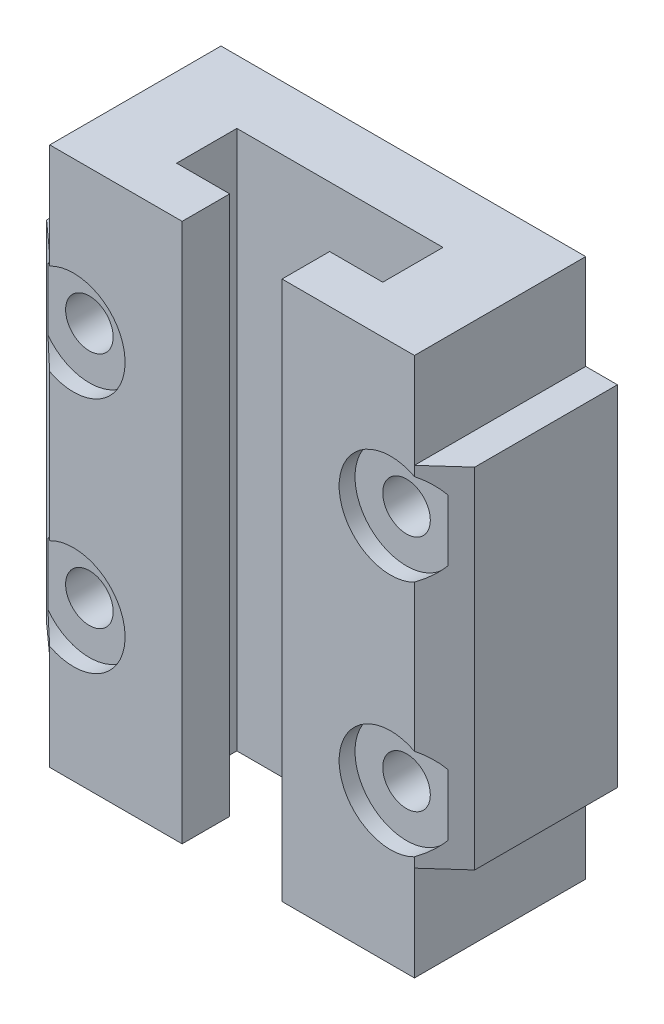
ISO-10303-21;
HEADER;
FILE_DESCRIPTION(('STEP AP214'),'2;1');
FILE_NAME('part.step','',(''),(''),'','','');
FILE_SCHEMA(('AUTOMOTIVE_DESIGN { 1 0 10303 214 1 1 1 1 }'));
ENDSEC;
DATA;
#1=APPLICATION_CONTEXT('core data for automotive mechanical design processes');
#2=APPLICATION_PROTOCOL_DEFINITION('international standard','automotive_design',2000,#1);
#3=PRODUCT_CONTEXT('',#1,'mechanical');
#4=PRODUCT('Part','Part','',(#3));
#5=PRODUCT_RELATED_PRODUCT_CATEGORY('part','',(#4));
#6=PRODUCT_DEFINITION_FORMATION('','',#4);
#7=PRODUCT_DEFINITION_CONTEXT('part definition',#1,'design');
#8=PRODUCT_DEFINITION('design','',#6,#7);
#9=PRODUCT_DEFINITION_SHAPE('','',#8);
#10=(LENGTH_UNIT() NAMED_UNIT(*) SI_UNIT(.MILLI.,.METRE.));
#11=(NAMED_UNIT(*) PLANE_ANGLE_UNIT() SI_UNIT($,.RADIAN.));
#12=(NAMED_UNIT(*) SI_UNIT($,.STERADIAN.) SOLID_ANGLE_UNIT());
#13=UNCERTAINTY_MEASURE_WITH_UNIT(LENGTH_MEASURE(1.E-05),#10,'distance_accuracy_value','');
#14=(GEOMETRIC_REPRESENTATION_CONTEXT(3) GLOBAL_UNCERTAINTY_ASSIGNED_CONTEXT((#13)) GLOBAL_UNIT_ASSIGNED_CONTEXT((#10,
#11,#12)) REPRESENTATION_CONTEXT('',''));
#15=CARTESIAN_POINT('',(0.,0.,0.));
#16=DIRECTION('',(0.,0.,1.));
#17=DIRECTION('',(1.,0.,0.));
#18=AXIS2_PLACEMENT_3D('',#15,#16,#17);
#19=CARTESIAN_POINT('',(-11.5,34.,5.4));
#20=DIRECTION('',(1.,0.,0.));
#21=DIRECTION('',(0.,0.,-1.));
#22=AXIS2_PLACEMENT_3D('',#19,#20,#21);
#23=PLANE('',#22);
#24=DIRECTION('',(0.,0.,1.));
#25=VECTOR('',#24,1.);
#26=CARTESIAN_POINT('',(-11.5,28.,5.4));
#27=LINE('',#26,#25);
#28=CARTESIAN_POINT('',(-11.5,28.,-5.4));
#29=VERTEX_POINT('',#28);
#30=CARTESIAN_POINT('',(-11.5,28.,5.4));
#31=VERTEX_POINT('',#30);
#32=EDGE_CURVE('E420',#29,#31,#27,.T.);
#33=ORIENTED_EDGE('',*,*,#32,.T.);
#34=DIRECTION('',(0.,-1.,0.));
#35=VECTOR('',#34,1.);
#36=CARTESIAN_POINT('',(-11.5,34.,5.4));
#37=LINE('',#36,#35);
#38=CARTESIAN_POINT('',(-11.5,34.,5.4));
#39=VERTEX_POINT('',#38);
#40=EDGE_CURVE('E252',#39,#31,#37,.T.);
#41=ORIENTED_EDGE('',*,*,#40,.F.);
#42=DIRECTION('',(0.,0.,1.));
#43=VECTOR('',#42,1.);
#44=CARTESIAN_POINT('',(-11.5,34.,5.4));
#45=LINE('',#44,#43);
#46=CARTESIAN_POINT('',(-11.5,34.,-5.4));
#47=VERTEX_POINT('',#46);
#48=EDGE_CURVE('E510',#47,#39,#45,.T.);
#49=ORIENTED_EDGE('',*,*,#48,.F.);
#50=DIRECTION('',(0.,-1.,0.));
#51=VECTOR('',#50,1.);
#52=CARTESIAN_POINT('',(-11.5,34.,-5.4));
#53=LINE('',#52,#51);
#54=EDGE_CURVE('E363',#47,#29,#53,.T.);
#55=ORIENTED_EDGE('',*,*,#54,.T.);
#56=EDGE_LOOP('',(#33,#41,#49,#55));
#57=FACE_BOUND('',#56,.T.);
#58=ADVANCED_FACE('F41',(#57),#23,.F.);
#59=CARTESIAN_POINT('',(11.5,34.,5.4));
#60=DIRECTION('',(-1.,0.,0.));
#61=DIRECTION('',(0.,0.,1.));
#62=AXIS2_PLACEMENT_3D('',#59,#60,#61);
#63=PLANE('',#62);
#64=DIRECTION('',(0.,-1.,0.));
#65=VECTOR('',#64,1.);
#66=CARTESIAN_POINT('',(11.5,34.,5.4));
#67=LINE('',#66,#65);
#68=CARTESIAN_POINT('',(11.5,34.,5.4));
#69=VERTEX_POINT('',#68);
#70=CARTESIAN_POINT('',(11.5,28.,5.4));
#71=VERTEX_POINT('',#70);
#72=EDGE_CURVE('E355',#69,#71,#67,.T.);
#73=ORIENTED_EDGE('',*,*,#72,.T.);
#74=DIRECTION('',(0.,0.,-1.));
#75=VECTOR('',#74,1.);
#76=CARTESIAN_POINT('',(11.5,28.,5.4));
#77=LINE('',#76,#75);
#78=CARTESIAN_POINT('',(11.5,28.,-5.4));
#79=VERTEX_POINT('',#78);
#80=EDGE_CURVE('E438',#71,#79,#77,.T.);
#81=ORIENTED_EDGE('',*,*,#80,.T.);
#82=DIRECTION('',(0.,-1.,0.));
#83=VECTOR('',#82,1.);
#84=CARTESIAN_POINT('',(11.5,34.,-5.4));
#85=LINE('',#84,#83);
#86=CARTESIAN_POINT('',(11.5,34.,-5.4));
#87=VERTEX_POINT('',#86);
#88=EDGE_CURVE('E366',#87,#79,#85,.T.);
#89=ORIENTED_EDGE('',*,*,#88,.F.);
#90=DIRECTION('',(0.,0.,-1.));
#91=VECTOR('',#90,1.);
#92=CARTESIAN_POINT('',(11.5,34.,5.4));
#93=LINE('',#92,#91);
#94=EDGE_CURVE('E504',#69,#87,#93,.T.);
#95=ORIENTED_EDGE('',*,*,#94,.F.);
#96=EDGE_LOOP('',(#73,#81,#89,#95));
#97=FACE_BOUND('',#96,.T.);
#98=ADVANCED_FACE('F326',(#97),#63,.F.);
#99=CARTESIAN_POINT('',(-11.5,34.,5.4));
#100=DIRECTION('',(0.,0.,-1.));
#101=DIRECTION('',(-1.,0.,0.));
#102=AXIS2_PLACEMENT_3D('',#99,#100,#101);
#103=PLANE('',#102);
#104=DIRECTION('',(0.,-1.,0.));
#105=VECTOR('',#104,1.);
#106=CARTESIAN_POINT('',(11.5,30.6907248094147,5.4));
#107=LINE('',#106,#105);
#108=CARTESIAN_POINT('',(11.5,21.6168593513323,5.4));
#109=VERTEX_POINT('',#108);
#110=CARTESIAN_POINT('',(11.5,12.3831406486677,5.4));
#111=VERTEX_POINT('',#110);
#112=EDGE_CURVE('E390',#109,#111,#107,.T.);
#113=ORIENTED_EDGE('',*,*,#112,.F.);
#114=CARTESIAN_POINT('',(10.,24.5,5.4));
#115=DIRECTION('',(0.,0.,1.));
#116=DIRECTION('',(-1.,0.,0.));
#117=AXIS2_PLACEMENT_3D('',#114,#115,#116);
#118=CIRCLE('',#117,3.25);
#119=CARTESIAN_POINT('',(11.5,27.3831406486677,5.4));
#120=VERTEX_POINT('',#119);
#121=EDGE_CURVE('E272',#120,#109,#118,.T.);
#122=ORIENTED_EDGE('',*,*,#121,.F.);
#123=EDGE_CURVE('E399',#71,#120,#107,.T.);
#124=ORIENTED_EDGE('',*,*,#123,.F.);
#125=ORIENTED_EDGE('',*,*,#72,.F.);
#126=DIRECTION('',(1.,0.,0.));
#127=VECTOR('',#126,1.);
#128=CARTESIAN_POINT('',(-11.5,34.,5.4));
#129=LINE('',#128,#127);
#130=CARTESIAN_POINT('',(3.15,34.,5.4));
#131=VERTEX_POINT('',#130);
#132=EDGE_CURVE('E512',#131,#69,#129,.T.);
#133=ORIENTED_EDGE('',*,*,#132,.F.);
#134=DIRECTION('',(0.,1.,0.));
#135=VECTOR('',#134,1.);
#136=CARTESIAN_POINT('',(3.15,0.,5.4));
#137=LINE('',#136,#135);
#138=CARTESIAN_POINT('',(3.15,0.,5.4));
#139=VERTEX_POINT('',#138);
#140=EDGE_CURVE('E492',#139,#131,#137,.T.);
#141=ORIENTED_EDGE('',*,*,#140,.F.);
#142=DIRECTION('',(1.,0.,0.));
#143=VECTOR('',#142,1.);
#144=CARTESIAN_POINT('',(-11.5,0.,5.4));
#145=LINE('',#144,#143);
#146=CARTESIAN_POINT('',(11.5,0.,5.4));
#147=VERTEX_POINT('',#146);
#148=EDGE_CURVE('E521',#139,#147,#145,.T.);
#149=ORIENTED_EDGE('',*,*,#148,.T.);
#150=CARTESIAN_POINT('',(11.5,6.00000000000001,5.4));
#151=VERTEX_POINT('',#150);
#152=EDGE_CURVE('E359',#151,#147,#67,.T.);
#153=ORIENTED_EDGE('',*,*,#152,.F.);
#154=CARTESIAN_POINT('',(11.5,6.61685935133232,5.4));
#155=VERTEX_POINT('',#154);
#156=EDGE_CURVE('E394',#155,#151,#107,.T.);
#157=ORIENTED_EDGE('',*,*,#156,.F.);
#158=CARTESIAN_POINT('',(10.,9.50000000000001,5.4));
#159=DIRECTION('',(0.,0.,1.));
#160=DIRECTION('',(1.,0.,0.));
#161=AXIS2_PLACEMENT_3D('',#158,#159,#160);
#162=CIRCLE('',#161,3.25);
#163=EDGE_CURVE('E276',#111,#155,#162,.T.);
#164=ORIENTED_EDGE('',*,*,#163,.F.);
#165=EDGE_LOOP('',(#113,#122,#124,#125,#133,#141,#149,#153,#157,#164));
#166=FACE_BOUND('',#165,.T.);
#167=ADVANCED_FACE('F333',(#166),#103,.F.);
#168=DIRECTION('',(0.,0.,1.));
#169=VECTOR('',#168,1.);
#170=CARTESIAN_POINT('',(11.5,6.00000000000001,5.4));
#171=LINE('',#170,#169);
#172=CARTESIAN_POINT('',(11.5,6.00000000000001,-5.4));
#173=VERTEX_POINT('',#172);
#174=EDGE_CURVE('E443',#173,#151,#171,.T.);
#175=ORIENTED_EDGE('',*,*,#174,.T.);
#176=ORIENTED_EDGE('',*,*,#152,.T.);
#177=DIRECTION('',(0.,0.,-1.));
#178=VECTOR('',#177,1.);
#179=CARTESIAN_POINT('',(11.5,0.,5.4));
#180=LINE('',#179,#178);
#181=CARTESIAN_POINT('',(11.5,0.,-5.4));
#182=VERTEX_POINT('',#181);
#183=EDGE_CURVE('E489',#147,#182,#180,.T.);
#184=ORIENTED_EDGE('',*,*,#183,.T.);
#185=EDGE_CURVE('E365',#173,#182,#85,.T.);
#186=ORIENTED_EDGE('',*,*,#185,.F.);
#187=EDGE_LOOP('',(#175,#176,#184,#186));
#188=FACE_BOUND('',#187,.T.);
#189=ADVANCED_FACE('F43',(#188),#63,.F.);
#190=CARTESIAN_POINT('',(-11.5,34.,-5.4));
#191=DIRECTION('',(0.,0.,1.));
#192=DIRECTION('',(1.,0.,0.));
#193=AXIS2_PLACEMENT_3D('',#190,#191,#192);
#194=PLANE('',#193);
#195=CARTESIAN_POINT('',(10.,24.5,-5.4));
#196=DIRECTION('',(0.,0.,1.));
#197=DIRECTION('',(1.,0.,0.));
#198=AXIS2_PLACEMENT_3D('',#195,#196,#197);
#199=CIRCLE('',#198,1.5);
#200=CARTESIAN_POINT('',(11.5,24.5,-5.4));
#201=VERTEX_POINT('',#200);
#202=EDGE_CURVE('E287',#201,#201,#199,.F.);
#203=ORIENTED_EDGE('',*,*,#202,.F.);
#204=EDGE_LOOP('',(#203));
#205=FACE_BOUND('',#204,.T.);
#206=CARTESIAN_POINT('',(-10.,9.50000000000001,-5.4));
#207=DIRECTION('',(0.,0.,1.));
#208=DIRECTION('',(1.,0.,0.));
#209=AXIS2_PLACEMENT_3D('',#206,#207,#208);
#210=CIRCLE('',#209,1.5);
#211=CARTESIAN_POINT('',(-8.5,9.50000000000001,-5.4));
#212=VERTEX_POINT('',#211);
#213=EDGE_CURVE('E288',#212,#212,#210,.F.);
#214=ORIENTED_EDGE('',*,*,#213,.F.);
#215=EDGE_LOOP('',(#214));
#216=FACE_BOUND('',#215,.T.);
#217=CARTESIAN_POINT('',(10.,9.50000000000001,-5.4));
#218=DIRECTION('',(0.,0.,1.));
#219=DIRECTION('',(1.,0.,0.));
#220=AXIS2_PLACEMENT_3D('',#217,#218,#219);
#221=CIRCLE('',#220,1.5);
#222=CARTESIAN_POINT('',(11.5,9.50000000000001,-5.4));
#223=VERTEX_POINT('',#222);
#224=EDGE_CURVE('E295',#223,#223,#221,.F.);
#225=ORIENTED_EDGE('',*,*,#224,.F.);
#226=EDGE_LOOP('',(#225));
#227=FACE_BOUND('',#226,.T.);
#228=CARTESIAN_POINT('',(-10.,24.5,-5.4));
#229=DIRECTION('',(0.,0.,1.));
#230=DIRECTION('',(1.,0.,0.));
#231=AXIS2_PLACEMENT_3D('',#228,#229,#230);
#232=CIRCLE('',#231,1.5);
#233=CARTESIAN_POINT('',(-8.5,24.5,-5.4));
#234=VERTEX_POINT('',#233);
#235=EDGE_CURVE('E274',#234,#234,#232,.F.);
#236=ORIENTED_EDGE('',*,*,#235,.F.);
#237=EDGE_LOOP('',(#236));
#238=FACE_BOUND('',#237,.T.);
#239=CARTESIAN_POINT('',(-11.5,6.00000000000001,-5.4));
#240=VERTEX_POINT('',#239);
#241=CARTESIAN_POINT('',(-11.5,0.,-5.4));
#242=VERTEX_POINT('',#241);
#243=EDGE_CURVE('E357',#240,#242,#53,.T.);
#244=ORIENTED_EDGE('',*,*,#243,.F.);
#245=DIRECTION('',(-1.,0.,0.));
#246=VECTOR('',#245,1.);
#247=CARTESIAN_POINT('',(-13.5,6.00000000000001,-5.4));
#248=LINE('',#247,#246);
#249=CARTESIAN_POINT('',(-13.5,6.00000000000001,-5.4));
#250=VERTEX_POINT('',#249);
#251=EDGE_CURVE('E413',#240,#250,#248,.T.);
#252=ORIENTED_EDGE('',*,*,#251,.T.);
#253=DIRECTION('',(0.,1.,0.));
#254=VECTOR('',#253,1.);
#255=CARTESIAN_POINT('',(-13.5,6.00000000000001,-5.4));
#256=LINE('',#255,#254);
#257=CARTESIAN_POINT('',(-13.5,28.,-5.4));
#258=VERTEX_POINT('',#257);
#259=EDGE_CURVE('E404',#250,#258,#256,.T.);
#260=ORIENTED_EDGE('',*,*,#259,.T.);
#261=DIRECTION('',(1.,0.,0.));
#262=VECTOR('',#261,1.);
#263=CARTESIAN_POINT('',(-13.5,28.,-5.4));
#264=LINE('',#263,#262);
#265=EDGE_CURVE('E408',#258,#29,#264,.T.);
#266=ORIENTED_EDGE('',*,*,#265,.T.);
#267=ORIENTED_EDGE('',*,*,#54,.F.);
#268=DIRECTION('',(-1.,0.,0.));
#269=VECTOR('',#268,1.);
#270=CARTESIAN_POINT('',(-11.5,34.,-5.4));
#271=LINE('',#270,#269);
#272=EDGE_CURVE('E507',#87,#47,#271,.T.);
#273=ORIENTED_EDGE('',*,*,#272,.F.);
#274=ORIENTED_EDGE('',*,*,#88,.T.);
#275=DIRECTION('',(1.,0.,0.));
#276=VECTOR('',#275,1.);
#277=CARTESIAN_POINT('',(13.5,28.,-5.4));
#278=LINE('',#277,#276);
#279=CARTESIAN_POINT('',(13.5,28.,-5.4));
#280=VERTEX_POINT('',#279);
#281=EDGE_CURVE('E425',#79,#280,#278,.T.);
#282=ORIENTED_EDGE('',*,*,#281,.T.);
#283=DIRECTION('',(0.,-1.,0.));
#284=VECTOR('',#283,1.);
#285=CARTESIAN_POINT('',(13.5,6.00000000000001,-5.4));
#286=LINE('',#285,#284);
#287=CARTESIAN_POINT('',(13.5,6.00000000000001,-5.4));
#288=VERTEX_POINT('',#287);
#289=EDGE_CURVE('E432',#280,#288,#286,.T.);
#290=ORIENTED_EDGE('',*,*,#289,.T.);
#291=DIRECTION('',(-1.,0.,0.));
#292=VECTOR('',#291,1.);
#293=CARTESIAN_POINT('',(13.5,6.00000000000001,-5.4));
#294=LINE('',#293,#292);
#295=EDGE_CURVE('E430',#288,#173,#294,.T.);
#296=ORIENTED_EDGE('',*,*,#295,.T.);
#297=ORIENTED_EDGE('',*,*,#185,.T.);
#298=DIRECTION('',(-1.,0.,0.));
#299=VECTOR('',#298,1.);
#300=CARTESIAN_POINT('',(-11.5,0.,-5.4));
#301=LINE('',#300,#299);
#302=EDGE_CURVE('E518',#182,#242,#301,.T.);
#303=ORIENTED_EDGE('',*,*,#302,.T.);
#304=EDGE_LOOP('',(#244,#252,#260,#266,#267,#273,#274,#282,#290,#296,#297,#303));
#305=FACE_BOUND('',#304,.T.);
#306=ADVANCED_FACE('F337',(#205,#216,#227,#238,#305),#194,.F.);
#307=CARTESIAN_POINT('',(-11.5,6.00000000000001,5.4));
#308=VERTEX_POINT('',#307);
#309=CARTESIAN_POINT('',(-11.5,0.,5.4));
#310=VERTEX_POINT('',#309);
#311=EDGE_CURVE('E348',#308,#310,#37,.T.);
#312=ORIENTED_EDGE('',*,*,#311,.F.);
#313=DIRECTION('',(0.,0.,-1.));
#314=VECTOR('',#313,1.);
#315=CARTESIAN_POINT('',(-11.5,6.00000000000001,5.4));
#316=LINE('',#315,#314);
#317=EDGE_CURVE('E349',#308,#240,#316,.T.);
#318=ORIENTED_EDGE('',*,*,#317,.T.);
#319=ORIENTED_EDGE('',*,*,#243,.T.);
#320=DIRECTION('',(0.,0.,1.));
#321=VECTOR('',#320,1.);
#322=CARTESIAN_POINT('',(-11.5,0.,5.4));
#323=LINE('',#322,#321);
#324=EDGE_CURVE('E352',#242,#310,#323,.T.);
#325=ORIENTED_EDGE('',*,*,#324,.T.);
#326=EDGE_LOOP('',(#312,#318,#319,#325));
#327=FACE_BOUND('',#326,.T.);
#328=ADVANCED_FACE('F329',(#327),#23,.F.);
#329=DIRECTION('',(0.,-1.,0.));
#330=VECTOR('',#329,1.);
#331=CARTESIAN_POINT('',(-11.5,30.6907248094147,5.4));
#332=LINE('',#331,#330);
#333=CARTESIAN_POINT('',(-11.5,21.6168593513323,5.4));
#334=VERTEX_POINT('',#333);
#335=CARTESIAN_POINT('',(-11.5,12.3831406486677,5.4));
#336=VERTEX_POINT('',#335);
#337=EDGE_CURVE('E254',#334,#336,#332,.T.);
#338=ORIENTED_EDGE('',*,*,#337,.T.);
#339=CARTESIAN_POINT('',(-10.,9.50000000000001,5.4));
#340=DIRECTION('',(0.,0.,1.));
#341=DIRECTION('',(-1.,0.,0.));
#342=AXIS2_PLACEMENT_3D('',#339,#340,#341);
#343=CIRCLE('',#342,3.25);
#344=CARTESIAN_POINT('',(-11.5,6.61685935133232,5.4));
#345=VERTEX_POINT('',#344);
#346=EDGE_CURVE('E279',#345,#336,#343,.T.);
#347=ORIENTED_EDGE('',*,*,#346,.F.);
#348=EDGE_CURVE('E256',#345,#308,#332,.T.);
#349=ORIENTED_EDGE('',*,*,#348,.T.);
#350=ORIENTED_EDGE('',*,*,#311,.T.);
#351=CARTESIAN_POINT('',(-3.15,0.,5.4));
#352=VERTEX_POINT('',#351);
#353=EDGE_CURVE('E508',#310,#352,#145,.T.);
#354=ORIENTED_EDGE('',*,*,#353,.T.);
#355=DIRECTION('',(0.,1.,0.));
#356=VECTOR('',#355,1.);
#357=CARTESIAN_POINT('',(-3.15,0.,5.4));
#358=LINE('',#357,#356);
#359=CARTESIAN_POINT('',(-3.15,34.,5.4));
#360=VERTEX_POINT('',#359);
#361=EDGE_CURVE('E494',#352,#360,#358,.T.);
#362=ORIENTED_EDGE('',*,*,#361,.T.);
#363=EDGE_CURVE('E513',#39,#360,#129,.T.);
#364=ORIENTED_EDGE('',*,*,#363,.F.);
#365=ORIENTED_EDGE('',*,*,#40,.T.);
#366=CARTESIAN_POINT('',(-11.5,27.3831406486677,5.4));
#367=VERTEX_POINT('',#366);
#368=EDGE_CURVE('E244',#31,#367,#332,.T.);
#369=ORIENTED_EDGE('',*,*,#368,.T.);
#370=CARTESIAN_POINT('',(-10.,24.5,5.4));
#371=DIRECTION('',(0.,0.,1.));
#372=DIRECTION('',(1.,0.,0.));
#373=AXIS2_PLACEMENT_3D('',#370,#371,#372);
#374=CIRCLE('',#373,3.25);
#375=EDGE_CURVE('E225',#334,#367,#374,.T.);
#376=ORIENTED_EDGE('',*,*,#375,.F.);
#377=EDGE_LOOP('',(#338,#347,#349,#350,#354,#362,#364,#365,#369,#376));
#378=FACE_BOUND('',#377,.T.);
#379=ADVANCED_FACE('F249',(#378),#103,.F.);
#380=CARTESIAN_POINT('',(0.,34.,0.));
#381=DIRECTION('',(0.,-1.,0.));
#382=DIRECTION('',(0.,0.,-1.));
#383=AXIS2_PLACEMENT_3D('',#380,#381,#382);
#384=PLANE('',#383);
#385=DIRECTION('',(1.,0.,0.));
#386=VECTOR('',#385,1.);
#387=CARTESIAN_POINT('',(6.5,34.,2.39999999999999));
#388=LINE('',#387,#386);
#389=CARTESIAN_POINT('',(3.15,34.,2.4));
#390=VERTEX_POINT('',#389);
#391=CARTESIAN_POINT('',(6.5,34.,2.39999999999999));
#392=VERTEX_POINT('',#391);
#393=EDGE_CURVE('E450',#390,#392,#388,.T.);
#394=ORIENTED_EDGE('',*,*,#393,.F.);
#395=DIRECTION('',(0.,0.,-1.));
#396=VECTOR('',#395,1.);
#397=CARTESIAN_POINT('',(3.15,34.,2.4));
#398=LINE('',#397,#396);
#399=EDGE_CURVE('E482',#131,#390,#398,.T.);
#400=ORIENTED_EDGE('',*,*,#399,.F.);
#401=ORIENTED_EDGE('',*,*,#132,.T.);
#402=ORIENTED_EDGE('',*,*,#94,.T.);
#403=ORIENTED_EDGE('',*,*,#272,.T.);
#404=ORIENTED_EDGE('',*,*,#48,.T.);
#405=ORIENTED_EDGE('',*,*,#363,.T.);
#406=DIRECTION('',(0.,0.,1.));
#407=VECTOR('',#406,1.);
#408=CARTESIAN_POINT('',(-3.15,34.,2.4));
#409=LINE('',#408,#407);
#410=CARTESIAN_POINT('',(-3.15,34.,2.4));
#411=VERTEX_POINT('',#410);
#412=EDGE_CURVE('E480',#411,#360,#409,.T.);
#413=ORIENTED_EDGE('',*,*,#412,.F.);
#414=DIRECTION('',(1.,0.,0.));
#415=VECTOR('',#414,1.);
#416=CARTESIAN_POINT('',(-6.5,34.,2.4));
#417=LINE('',#416,#415);
#418=CARTESIAN_POINT('',(-6.5,34.,2.4));
#419=VERTEX_POINT('',#418);
#420=EDGE_CURVE('E477',#419,#411,#417,.T.);
#421=ORIENTED_EDGE('',*,*,#420,.F.);
#422=DIRECTION('',(0.,0.,1.));
#423=VECTOR('',#422,1.);
#424=CARTESIAN_POINT('',(-6.5,34.,-1.4));
#425=LINE('',#424,#423);
#426=CARTESIAN_POINT('',(-6.5,34.,-1.4));
#427=VERTEX_POINT('',#426);
#428=EDGE_CURVE('E474',#427,#419,#425,.T.);
#429=ORIENTED_EDGE('',*,*,#428,.F.);
#430=DIRECTION('',(-1.,0.,0.));
#431=VECTOR('',#430,1.);
#432=CARTESIAN_POINT('',(-6.5,34.,-1.4));
#433=LINE('',#432,#431);
#434=CARTESIAN_POINT('',(6.5,34.,-1.4));
#435=VERTEX_POINT('',#434);
#436=EDGE_CURVE('E471',#435,#427,#433,.T.);
#437=ORIENTED_EDGE('',*,*,#436,.F.);
#438=DIRECTION('',(0.,0.,-1.));
#439=VECTOR('',#438,1.);
#440=CARTESIAN_POINT('',(6.5,34.,-1.4));
#441=LINE('',#440,#439);
#442=EDGE_CURVE('E445',#392,#435,#441,.T.);
#443=ORIENTED_EDGE('',*,*,#442,.F.);
#444=EDGE_LOOP('',(#394,#400,#401,#402,#403,#404,#405,#413,#421,#429,#437,#443));
#445=FACE_BOUND('',#444,.T.);
#446=ADVANCED_FACE('F343',(#445),#384,.F.);
#447=CARTESIAN_POINT('',(0.,0.,0.));
#448=DIRECTION('',(0.,-1.,0.));
#449=DIRECTION('',(0.,0.,-1.));
#450=AXIS2_PLACEMENT_3D('',#447,#448,#449);
#451=PLANE('',#450);
#452=DIRECTION('',(0.,0.,-1.));
#453=VECTOR('',#452,1.);
#454=CARTESIAN_POINT('',(3.15,0.,2.4));
#455=LINE('',#454,#453);
#456=CARTESIAN_POINT('',(3.15,0.,2.4));
#457=VERTEX_POINT('',#456);
#458=EDGE_CURVE('E462',#139,#457,#455,.T.);
#459=ORIENTED_EDGE('',*,*,#458,.T.);
#460=DIRECTION('',(1.,0.,0.));
#461=VECTOR('',#460,1.);
#462=CARTESIAN_POINT('',(6.5,0.,2.39999999999999));
#463=LINE('',#462,#461);
#464=CARTESIAN_POINT('',(6.5,0.,2.39999999999999));
#465=VERTEX_POINT('',#464);
#466=EDGE_CURVE('E465',#457,#465,#463,.T.);
#467=ORIENTED_EDGE('',*,*,#466,.T.);
#468=DIRECTION('',(0.,0.,-1.));
#469=VECTOR('',#468,1.);
#470=CARTESIAN_POINT('',(6.5,0.,-1.4));
#471=LINE('',#470,#469);
#472=CARTESIAN_POINT('',(6.5,0.,-1.4));
#473=VERTEX_POINT('',#472);
#474=EDGE_CURVE('E446',#465,#473,#471,.T.);
#475=ORIENTED_EDGE('',*,*,#474,.T.);
#476=DIRECTION('',(-1.,0.,0.));
#477=VECTOR('',#476,1.);
#478=CARTESIAN_POINT('',(-6.5,0.,-1.4));
#479=LINE('',#478,#477);
#480=CARTESIAN_POINT('',(-6.5,0.,-1.4));
#481=VERTEX_POINT('',#480);
#482=EDGE_CURVE('E449',#473,#481,#479,.T.);
#483=ORIENTED_EDGE('',*,*,#482,.T.);
#484=DIRECTION('',(0.,0.,1.));
#485=VECTOR('',#484,1.);
#486=CARTESIAN_POINT('',(-6.5,0.,-1.4));
#487=LINE('',#486,#485);
#488=CARTESIAN_POINT('',(-6.5,0.,2.4));
#489=VERTEX_POINT('',#488);
#490=EDGE_CURVE('E453',#481,#489,#487,.T.);
#491=ORIENTED_EDGE('',*,*,#490,.T.);
#492=DIRECTION('',(1.,0.,0.));
#493=VECTOR('',#492,1.);
#494=CARTESIAN_POINT('',(-6.5,0.,2.4));
#495=LINE('',#494,#493);
#496=CARTESIAN_POINT('',(-3.15,0.,2.4));
#497=VERTEX_POINT('',#496);
#498=EDGE_CURVE('E456',#489,#497,#495,.T.);
#499=ORIENTED_EDGE('',*,*,#498,.T.);
#500=DIRECTION('',(0.,0.,1.));
#501=VECTOR('',#500,1.);
#502=CARTESIAN_POINT('',(-3.15,0.,2.4));
#503=LINE('',#502,#501);
#504=EDGE_CURVE('E459',#497,#352,#503,.T.);
#505=ORIENTED_EDGE('',*,*,#504,.T.);
#506=ORIENTED_EDGE('',*,*,#353,.F.);
#507=ORIENTED_EDGE('',*,*,#324,.F.);
#508=ORIENTED_EDGE('',*,*,#302,.F.);
#509=ORIENTED_EDGE('',*,*,#183,.F.);
#510=ORIENTED_EDGE('',*,*,#148,.F.);
#511=EDGE_LOOP('',(#459,#467,#475,#483,#491,#499,#505,#506,#507,#508,#509,#510));
#512=FACE_BOUND('',#511,.T.);
#513=ADVANCED_FACE('F528',(#512),#451,.T.);
#514=CARTESIAN_POINT('',(6.5,0.,-1.4));
#515=DIRECTION('',(1.,0.,0.));
#516=DIRECTION('',(0.,0.,-1.));
#517=AXIS2_PLACEMENT_3D('',#514,#515,#516);
#518=PLANE('',#517);
#519=ORIENTED_EDGE('',*,*,#442,.T.);
#520=DIRECTION('',(0.,1.,0.));
#521=VECTOR('',#520,1.);
#522=CARTESIAN_POINT('',(6.5,0.,-1.4));
#523=LINE('',#522,#521);
#524=EDGE_CURVE('E468',#473,#435,#523,.T.);
#525=ORIENTED_EDGE('',*,*,#524,.F.);
#526=ORIENTED_EDGE('',*,*,#474,.F.);
#527=DIRECTION('',(0.,1.,0.));
#528=VECTOR('',#527,1.);
#529=CARTESIAN_POINT('',(6.5,0.,2.39999999999999));
#530=LINE('',#529,#528);
#531=EDGE_CURVE('E487',#465,#392,#530,.T.);
#532=ORIENTED_EDGE('',*,*,#531,.T.);
#533=EDGE_LOOP('',(#519,#525,#526,#532));
#534=FACE_BOUND('',#533,.T.);
#535=ADVANCED_FACE('F560',(#534),#518,.F.);
#536=CARTESIAN_POINT('',(6.5,0.,2.39999999999999));
#537=DIRECTION('',(0.,0.,1.));
#538=DIRECTION('',(1.,0.,0.));
#539=AXIS2_PLACEMENT_3D('',#536,#537,#538);
#540=PLANE('',#539);
#541=ORIENTED_EDGE('',*,*,#393,.T.);
#542=ORIENTED_EDGE('',*,*,#531,.F.);
#543=ORIENTED_EDGE('',*,*,#466,.F.);
#544=DIRECTION('',(0.,1.,0.));
#545=VECTOR('',#544,1.);
#546=CARTESIAN_POINT('',(3.15,0.,2.4));
#547=LINE('',#546,#545);
#548=EDGE_CURVE('E490',#457,#390,#547,.T.);
#549=ORIENTED_EDGE('',*,*,#548,.T.);
#550=EDGE_LOOP('',(#541,#542,#543,#549));
#551=FACE_BOUND('',#550,.T.);
#552=ADVANCED_FACE('F558',(#551),#540,.F.);
#553=CARTESIAN_POINT('',(3.15,0.,2.4));
#554=DIRECTION('',(1.,0.,0.));
#555=DIRECTION('',(0.,0.,-1.));
#556=AXIS2_PLACEMENT_3D('',#553,#554,#555);
#557=PLANE('',#556);
#558=ORIENTED_EDGE('',*,*,#399,.T.);
#559=ORIENTED_EDGE('',*,*,#548,.F.);
#560=ORIENTED_EDGE('',*,*,#458,.F.);
#561=ORIENTED_EDGE('',*,*,#140,.T.);
#562=EDGE_LOOP('',(#558,#559,#560,#561));
#563=FACE_BOUND('',#562,.T.);
#564=ADVANCED_FACE('F554',(#563),#557,.F.);
#565=CARTESIAN_POINT('',(-3.15,0.,2.4));
#566=DIRECTION('',(-1.,0.,0.));
#567=DIRECTION('',(0.,0.,1.));
#568=AXIS2_PLACEMENT_3D('',#565,#566,#567);
#569=PLANE('',#568);
#570=ORIENTED_EDGE('',*,*,#412,.T.);
#571=ORIENTED_EDGE('',*,*,#361,.F.);
#572=ORIENTED_EDGE('',*,*,#504,.F.);
#573=DIRECTION('',(0.,1.,0.));
#574=VECTOR('',#573,1.);
#575=CARTESIAN_POINT('',(-3.15,0.,2.4));
#576=LINE('',#575,#574);
#577=EDGE_CURVE('E497',#497,#411,#576,.T.);
#578=ORIENTED_EDGE('',*,*,#577,.T.);
#579=EDGE_LOOP('',(#570,#571,#572,#578));
#580=FACE_BOUND('',#579,.T.);
#581=ADVANCED_FACE('F576',(#580),#569,.F.);
#582=CARTESIAN_POINT('',(-6.5,0.,2.4));
#583=DIRECTION('',(0.,0.,1.));
#584=DIRECTION('',(1.,0.,0.));
#585=AXIS2_PLACEMENT_3D('',#582,#583,#584);
#586=PLANE('',#585);
#587=ORIENTED_EDGE('',*,*,#420,.T.);
#588=ORIENTED_EDGE('',*,*,#577,.F.);
#589=ORIENTED_EDGE('',*,*,#498,.F.);
#590=DIRECTION('',(0.,1.,0.));
#591=VECTOR('',#590,1.);
#592=CARTESIAN_POINT('',(-6.5,0.,2.4));
#593=LINE('',#592,#591);
#594=EDGE_CURVE('E499',#489,#419,#593,.T.);
#595=ORIENTED_EDGE('',*,*,#594,.T.);
#596=EDGE_LOOP('',(#587,#588,#589,#595));
#597=FACE_BOUND('',#596,.T.);
#598=ADVANCED_FACE('F572',(#597),#586,.F.);
#599=CARTESIAN_POINT('',(-6.5,0.,-1.4));
#600=DIRECTION('',(-1.,0.,0.));
#601=DIRECTION('',(0.,0.,1.));
#602=AXIS2_PLACEMENT_3D('',#599,#600,#601);
#603=PLANE('',#602);
#604=ORIENTED_EDGE('',*,*,#428,.T.);
#605=ORIENTED_EDGE('',*,*,#594,.F.);
#606=ORIENTED_EDGE('',*,*,#490,.F.);
#607=DIRECTION('',(0.,1.,0.));
#608=VECTOR('',#607,1.);
#609=CARTESIAN_POINT('',(-6.5,0.,-1.4));
#610=LINE('',#609,#608);
#611=EDGE_CURVE('E501',#481,#427,#610,.T.);
#612=ORIENTED_EDGE('',*,*,#611,.T.);
#613=EDGE_LOOP('',(#604,#605,#606,#612));
#614=FACE_BOUND('',#613,.T.);
#615=ADVANCED_FACE('F568',(#614),#603,.F.);
#616=CARTESIAN_POINT('',(-6.5,0.,-1.4));
#617=DIRECTION('',(0.,0.,-1.));
#618=DIRECTION('',(-1.,0.,0.));
#619=AXIS2_PLACEMENT_3D('',#616,#617,#618);
#620=PLANE('',#619);
#621=ORIENTED_EDGE('',*,*,#436,.T.);
#622=ORIENTED_EDGE('',*,*,#611,.F.);
#623=ORIENTED_EDGE('',*,*,#482,.F.);
#624=ORIENTED_EDGE('',*,*,#524,.T.);
#625=EDGE_LOOP('',(#621,#622,#623,#624));
#626=FACE_BOUND('',#625,.T.);
#627=ADVANCED_FACE('F565',(#626),#620,.F.);
#628=CARTESIAN_POINT('',(13.5,6.00000000000001,3.6));
#629=DIRECTION('',(0.,-1.,0.));
#630=DIRECTION('',(0.,0.,-1.));
#631=AXIS2_PLACEMENT_3D('',#628,#629,#630);
#632=PLANE('',#631);
#633=ORIENTED_EDGE('',*,*,#174,.F.);
#634=ORIENTED_EDGE('',*,*,#295,.F.);
#635=DIRECTION('',(0.,0.,-1.));
#636=VECTOR('',#635,1.);
#637=CARTESIAN_POINT('',(13.5,6.00000000000001,3.6));
#638=LINE('',#637,#636);
#639=CARTESIAN_POINT('',(13.5,6.00000000000001,3.6));
#640=VERTEX_POINT('',#639);
#641=EDGE_CURVE('E436',#640,#288,#638,.T.);
#642=ORIENTED_EDGE('',*,*,#641,.F.);
#643=DIRECTION('',(-0.743294146247166,0.,0.66896473162245));
#644=VECTOR('',#643,1.);
#645=CARTESIAN_POINT('',(13.5,6.00000000000001,3.6));
#646=LINE('',#645,#644);
#647=EDGE_CURVE('E257',#640,#151,#646,.T.);
#648=ORIENTED_EDGE('',*,*,#647,.T.);
#649=EDGE_LOOP('',(#633,#634,#642,#648));
#650=FACE_BOUND('',#649,.T.);
#651=ADVANCED_FACE('F536',(#650),#632,.T.);
#652=CARTESIAN_POINT('',(13.5,28.,3.6));
#653=DIRECTION('',(0.,1.,0.));
#654=DIRECTION('',(0.,0.,1.));
#655=AXIS2_PLACEMENT_3D('',#652,#653,#654);
#656=PLANE('',#655);
#657=ORIENTED_EDGE('',*,*,#80,.F.);
#658=DIRECTION('',(-0.743294146247166,0.,0.66896473162245));
#659=VECTOR('',#658,1.);
#660=CARTESIAN_POINT('',(13.5,28.,3.6));
#661=LINE('',#660,#659);
#662=CARTESIAN_POINT('',(13.5,28.,3.6));
#663=VERTEX_POINT('',#662);
#664=EDGE_CURVE('E397',#663,#71,#661,.T.);
#665=ORIENTED_EDGE('',*,*,#664,.F.);
#666=DIRECTION('',(0.,0.,-1.));
#667=VECTOR('',#666,1.);
#668=CARTESIAN_POINT('',(13.5,28.,3.6));
#669=LINE('',#668,#667);
#670=EDGE_CURVE('E429',#663,#280,#669,.T.);
#671=ORIENTED_EDGE('',*,*,#670,.T.);
#672=ORIENTED_EDGE('',*,*,#281,.F.);
#673=EDGE_LOOP('',(#657,#665,#671,#672));
#674=FACE_BOUND('',#673,.T.);
#675=ADVANCED_FACE('F543',(#674),#656,.T.);
#676=CARTESIAN_POINT('',(13.5,6.00000000000001,3.6));
#677=DIRECTION('',(1.,0.,0.));
#678=DIRECTION('',(0.,0.,-1.));
#679=AXIS2_PLACEMENT_3D('',#676,#677,#678);
#680=PLANE('',#679);
#681=ORIENTED_EDGE('',*,*,#289,.F.);
#682=ORIENTED_EDGE('',*,*,#670,.F.);
#683=DIRECTION('',(0.,-1.,0.));
#684=VECTOR('',#683,1.);
#685=CARTESIAN_POINT('',(13.5,6.00000000000001,3.6));
#686=LINE('',#685,#684);
#687=EDGE_CURVE('E426',#663,#640,#686,.T.);
#688=ORIENTED_EDGE('',*,*,#687,.T.);
#689=ORIENTED_EDGE('',*,*,#641,.T.);
#690=EDGE_LOOP('',(#681,#682,#688,#689));
#691=FACE_BOUND('',#690,.T.);
#692=ADVANCED_FACE('F541',(#691),#680,.T.);
#693=CARTESIAN_POINT('',(-13.5,6.00000000000001,3.6));
#694=DIRECTION('',(0.,-1.,0.));
#695=DIRECTION('',(1.,0.,0.));
#696=AXIS2_PLACEMENT_3D('',#693,#694,#695);
#697=PLANE('',#696);
#698=ORIENTED_EDGE('',*,*,#317,.F.);
#699=DIRECTION('',(-0.743294146247166,0.,-0.66896473162245));
#700=VECTOR('',#699,1.);
#701=CARTESIAN_POINT('',(-13.5,6.00000000000001,3.6));
#702=LINE('',#701,#700);
#703=CARTESIAN_POINT('',(-13.5,6.00000000000001,3.6));
#704=VERTEX_POINT('',#703);
#705=EDGE_CURVE('E260',#308,#704,#702,.T.);
#706=ORIENTED_EDGE('',*,*,#705,.T.);
#707=DIRECTION('',(0.,0.,-1.));
#708=VECTOR('',#707,1.);
#709=CARTESIAN_POINT('',(-13.5,6.00000000000001,3.6));
#710=LINE('',#709,#708);
#711=EDGE_CURVE('E418',#704,#250,#710,.T.);
#712=ORIENTED_EDGE('',*,*,#711,.T.);
#713=ORIENTED_EDGE('',*,*,#251,.F.);
#714=EDGE_LOOP('',(#698,#706,#712,#713));
#715=FACE_BOUND('',#714,.T.);
#716=ADVANCED_FACE('F586',(#715),#697,.T.);
#717=CARTESIAN_POINT('',(-13.5,28.,3.6));
#718=DIRECTION('',(0.,1.,0.));
#719=DIRECTION('',(-1.,0.,0.));
#720=AXIS2_PLACEMENT_3D('',#717,#718,#719);
#721=PLANE('',#720);
#722=ORIENTED_EDGE('',*,*,#32,.F.);
#723=ORIENTED_EDGE('',*,*,#265,.F.);
#724=DIRECTION('',(0.,0.,-1.));
#725=VECTOR('',#724,1.);
#726=CARTESIAN_POINT('',(-13.5,28.,3.6));
#727=LINE('',#726,#725);
#728=CARTESIAN_POINT('',(-13.5,28.,3.6));
#729=VERTEX_POINT('',#728);
#730=EDGE_CURVE('E421',#729,#258,#727,.T.);
#731=ORIENTED_EDGE('',*,*,#730,.F.);
#732=DIRECTION('',(-0.743294146247166,0.,-0.66896473162245));
#733=VECTOR('',#732,1.);
#734=CARTESIAN_POINT('',(-13.5,28.,3.6));
#735=LINE('',#734,#733);
#736=EDGE_CURVE('E253',#31,#729,#735,.T.);
#737=ORIENTED_EDGE('',*,*,#736,.F.);
#738=EDGE_LOOP('',(#722,#723,#731,#737));
#739=FACE_BOUND('',#738,.T.);
#740=ADVANCED_FACE('F582',(#739),#721,.T.);
#741=CARTESIAN_POINT('',(-13.5,6.00000000000001,3.6));
#742=DIRECTION('',(-1.,0.,0.));
#743=DIRECTION('',(0.,-1.,0.));
#744=AXIS2_PLACEMENT_3D('',#741,#742,#743);
#745=PLANE('',#744);
#746=ORIENTED_EDGE('',*,*,#259,.F.);
#747=ORIENTED_EDGE('',*,*,#711,.F.);
#748=DIRECTION('',(0.,1.,0.));
#749=VECTOR('',#748,1.);
#750=CARTESIAN_POINT('',(-13.5,6.00000000000001,3.6));
#751=LINE('',#750,#749);
#752=EDGE_CURVE('E415',#704,#729,#751,.T.);
#753=ORIENTED_EDGE('',*,*,#752,.T.);
#754=ORIENTED_EDGE('',*,*,#730,.T.);
#755=EDGE_LOOP('',(#746,#747,#753,#754));
#756=FACE_BOUND('',#755,.T.);
#757=ADVANCED_FACE('F585',(#756),#745,.T.);
#758=CARTESIAN_POINT('',(13.5,30.6907248094147,3.6));
#759=DIRECTION('',(0.66896473162245,0.,0.743294146247166));
#760=DIRECTION('',(0.743294146247166,0.,-0.66896473162245));
#761=AXIS2_PLACEMENT_3D('',#758,#759,#760);
#762=PLANE('',#761);
#763=CARTESIAN_POINT('',(10.,24.5,6.75));
#764=DIRECTION('',(0.66896473162245,0.,0.743294146247166));
#765=DIRECTION('',(-0.743294146247166,0.,0.66896473162245));
#766=AXIS2_PLACEMENT_3D('',#763,#764,#765);
#767=ELLIPSE('',#766,4.37242781529896,3.25);
#768=CARTESIAN_POINT('',(12.6111111111111,22.5649034221951,4.4));
#769=VERTEX_POINT('',#768);
#770=EDGE_CURVE('E11',#109,#769,#767,.T.);
#771=ORIENTED_EDGE('',*,*,#770,.F.);
#772=ORIENTED_EDGE('',*,*,#112,.T.);
#773=CARTESIAN_POINT('',(10.,9.50000000000001,6.75));
#774=DIRECTION('',(0.66896473162245,0.,0.743294146247166));
#775=DIRECTION('',(-0.743294146247166,0.,0.66896473162245));
#776=AXIS2_PLACEMENT_3D('',#773,#774,#775);
#777=ELLIPSE('',#776,4.37242781529896,3.25);
#778=CARTESIAN_POINT('',(12.6111111111111,11.4350965778049,4.4));
#779=VERTEX_POINT('',#778);
#780=EDGE_CURVE('E377',#779,#111,#777,.T.);
#781=ORIENTED_EDGE('',*,*,#780,.F.);
#782=DIRECTION('',(0.,-1.,0.));
#783=VECTOR('',#782,1.);
#784=CARTESIAN_POINT('',(12.6111111111111,30.6907248094147,4.4));
#785=LINE('',#784,#783);
#786=CARTESIAN_POINT('',(12.6111111111111,7.56490342219514,4.4));
#787=VERTEX_POINT('',#786);
#788=EDGE_CURVE('E374',#779,#787,#785,.T.);
#789=ORIENTED_EDGE('',*,*,#788,.T.);
#790=EDGE_CURVE('E378',#155,#787,#777,.T.);
#791=ORIENTED_EDGE('',*,*,#790,.F.);
#792=ORIENTED_EDGE('',*,*,#156,.T.);
#793=ORIENTED_EDGE('',*,*,#647,.F.);
#794=ORIENTED_EDGE('',*,*,#687,.F.);
#795=ORIENTED_EDGE('',*,*,#664,.T.);
#796=ORIENTED_EDGE('',*,*,#123,.T.);
#797=CARTESIAN_POINT('',(12.6111111111111,26.4350965778049,4.4));
#798=VERTEX_POINT('',#797);
#799=EDGE_CURVE('E45',#798,#120,#767,.T.);
#800=ORIENTED_EDGE('',*,*,#799,.F.);
#801=DIRECTION('',(0.,1.,0.));
#802=VECTOR('',#801,1.);
#803=CARTESIAN_POINT('',(12.6111111111111,30.6907248094147,4.4));
#804=LINE('',#803,#802);
#805=EDGE_CURVE('E379',#769,#798,#804,.T.);
#806=ORIENTED_EDGE('',*,*,#805,.F.);
#807=EDGE_LOOP('',(#771,#772,#781,#789,#791,#792,#793,#794,#795,#796,#800,#806));
#808=FACE_BOUND('',#807,.T.);
#809=ADVANCED_FACE('F387',(#808),#762,.T.);
#810=CARTESIAN_POINT('',(-13.5,30.6907248094147,3.6));
#811=DIRECTION('',(-0.66896473162245,0.,0.743294146247166));
#812=DIRECTION('',(0.743294146247166,0.,0.66896473162245));
#813=AXIS2_PLACEMENT_3D('',#810,#811,#812);
#814=PLANE('',#813);
#815=CARTESIAN_POINT('',(-10.,9.50000000000001,6.75));
#816=DIRECTION('',(-0.66896473162245,0.,0.743294146247166));
#817=DIRECTION('',(0.743294146247166,0.,0.66896473162245));
#818=AXIS2_PLACEMENT_3D('',#815,#816,#817);
#819=ELLIPSE('',#818,4.37242781529896,3.25);
#820=CARTESIAN_POINT('',(-12.6111111111111,11.4350965778049,4.4));
#821=VERTEX_POINT('',#820);
#822=EDGE_CURVE('E373',#336,#821,#819,.T.);
#823=ORIENTED_EDGE('',*,*,#822,.F.);
#824=ORIENTED_EDGE('',*,*,#337,.F.);
#825=CARTESIAN_POINT('',(-10.,24.5,6.75));
#826=DIRECTION('',(-0.66896473162245,0.,0.743294146247166));
#827=DIRECTION('',(0.743294146247166,0.,0.66896473162245));
#828=AXIS2_PLACEMENT_3D('',#825,#826,#827);
#829=ELLIPSE('',#828,4.37242781529896,3.25);
#830=CARTESIAN_POINT('',(-12.6111111111111,22.5649034221951,4.4));
#831=VERTEX_POINT('',#830);
#832=EDGE_CURVE('E232',#831,#334,#829,.T.);
#833=ORIENTED_EDGE('',*,*,#832,.F.);
#834=DIRECTION('',(0.,1.,0.));
#835=VECTOR('',#834,1.);
#836=CARTESIAN_POINT('',(-12.6111111111111,30.6907248094147,4.4));
#837=LINE('',#836,#835);
#838=CARTESIAN_POINT('',(-12.6111111111111,26.4350965778049,4.4));
#839=VERTEX_POINT('',#838);
#840=EDGE_CURVE('E246',#831,#839,#837,.T.);
#841=ORIENTED_EDGE('',*,*,#840,.T.);
#842=EDGE_CURVE('E229',#367,#839,#829,.T.);
#843=ORIENTED_EDGE('',*,*,#842,.F.);
#844=ORIENTED_EDGE('',*,*,#368,.F.);
#845=ORIENTED_EDGE('',*,*,#736,.T.);
#846=ORIENTED_EDGE('',*,*,#752,.F.);
#847=ORIENTED_EDGE('',*,*,#705,.F.);
#848=ORIENTED_EDGE('',*,*,#348,.F.);
#849=CARTESIAN_POINT('',(-12.6111111111111,7.56490342219515,4.4));
#850=VERTEX_POINT('',#849);
#851=EDGE_CURVE('E371',#850,#345,#819,.T.);
#852=ORIENTED_EDGE('',*,*,#851,.F.);
#853=DIRECTION('',(0.,-1.,0.));
#854=VECTOR('',#853,1.);
#855=CARTESIAN_POINT('',(-12.6111111111111,30.6907248094147,4.4));
#856=LINE('',#855,#854);
#857=EDGE_CURVE('E247',#821,#850,#856,.T.);
#858=ORIENTED_EDGE('',*,*,#857,.F.);
#859=EDGE_LOOP('',(#823,#824,#833,#841,#843,#844,#845,#846,#847,#848,#852,#858));
#860=FACE_BOUND('',#859,.T.);
#861=ADVANCED_FACE('F243',(#860),#814,.T.);
#862=CARTESIAN_POINT('',(-10.,24.5,4.4));
#863=DIRECTION('',(0.,0.,1.));
#864=DIRECTION('',(1.,0.,0.));
#865=AXIS2_PLACEMENT_3D('',#862,#863,#864);
#866=CYLINDRICAL_SURFACE('',#865,3.25);
#867=ORIENTED_EDGE('',*,*,#842,.T.);
#868=CARTESIAN_POINT('',(-10.,24.5,4.4));
#869=DIRECTION('',(0.,0.,1.));
#870=DIRECTION('',(1.,0.,0.));
#871=AXIS2_PLACEMENT_3D('',#868,#869,#870);
#872=CIRCLE('',#871,3.25);
#873=EDGE_CURVE('E237',#831,#839,#872,.T.);
#874=ORIENTED_EDGE('',*,*,#873,.F.);
#875=ORIENTED_EDGE('',*,*,#832,.T.);
#876=ORIENTED_EDGE('',*,*,#375,.T.);
#877=EDGE_LOOP('',(#867,#874,#875,#876));
#878=FACE_BOUND('',#877,.T.);
#879=ADVANCED_FACE('F227',(#878),#866,.F.);
#880=CARTESIAN_POINT('',(-10.,24.5,4.4));
#881=DIRECTION('',(0.,0.,1.));
#882=DIRECTION('',(1.,0.,0.));
#883=AXIS2_PLACEMENT_3D('',#880,#881,#882);
#884=PLANE('',#883);
#885=CARTESIAN_POINT('',(-10.,24.5,4.4));
#886=DIRECTION('',(0.,0.,1.));
#887=DIRECTION('',(1.,0.,0.));
#888=AXIS2_PLACEMENT_3D('',#885,#886,#887);
#889=CIRCLE('',#888,1.5);
#890=CARTESIAN_POINT('',(-8.5,24.5,4.4));
#891=VERTEX_POINT('',#890);
#892=EDGE_CURVE('E284',#891,#891,#889,.T.);
#893=ORIENTED_EDGE('',*,*,#892,.F.);
#894=EDGE_LOOP('',(#893));
#895=FACE_BOUND('',#894,.T.);
#896=ORIENTED_EDGE('',*,*,#873,.T.);
#897=ORIENTED_EDGE('',*,*,#840,.F.);
#898=EDGE_LOOP('',(#896,#897));
#899=FACE_BOUND('',#898,.T.);
#900=ADVANCED_FACE('F725',(#895,#899),#884,.T.);
#901=CARTESIAN_POINT('',(-10.,9.50000000000001,4.4));
#902=DIRECTION('',(0.,0.,1.));
#903=DIRECTION('',(1.,0.,0.));
#904=AXIS2_PLACEMENT_3D('',#901,#902,#903);
#905=CYLINDRICAL_SURFACE('',#904,3.25);
#906=ORIENTED_EDGE('',*,*,#822,.T.);
#907=CARTESIAN_POINT('',(-10.,9.50000000000001,4.4));
#908=DIRECTION('',(0.,0.,1.));
#909=DIRECTION('',(-1.,0.,0.));
#910=AXIS2_PLACEMENT_3D('',#907,#908,#909);
#911=CIRCLE('',#910,3.25);
#912=EDGE_CURVE('E238',#850,#821,#911,.T.);
#913=ORIENTED_EDGE('',*,*,#912,.F.);
#914=ORIENTED_EDGE('',*,*,#851,.T.);
#915=ORIENTED_EDGE('',*,*,#346,.T.);
#916=EDGE_LOOP('',(#906,#913,#914,#915));
#917=FACE_BOUND('',#916,.T.);
#918=ADVANCED_FACE('F732',(#917),#905,.F.);
#919=CARTESIAN_POINT('',(-10.,9.50000000000001,4.4));
#920=DIRECTION('',(0.,0.,-1.));
#921=DIRECTION('',(-1.,0.,0.));
#922=AXIS2_PLACEMENT_3D('',#919,#920,#921);
#923=PLANE('',#922);
#924=CARTESIAN_POINT('',(-10.,9.50000000000001,4.4));
#925=DIRECTION('',(0.,0.,1.));
#926=DIRECTION('',(1.,0.,0.));
#927=AXIS2_PLACEMENT_3D('',#924,#925,#926);
#928=CIRCLE('',#927,1.5);
#929=CARTESIAN_POINT('',(-8.5,9.50000000000001,4.4));
#930=VERTEX_POINT('',#929);
#931=EDGE_CURVE('E292',#930,#930,#928,.T.);
#932=ORIENTED_EDGE('',*,*,#931,.F.);
#933=EDGE_LOOP('',(#932));
#934=FACE_BOUND('',#933,.T.);
#935=ORIENTED_EDGE('',*,*,#857,.T.);
#936=ORIENTED_EDGE('',*,*,#912,.T.);
#937=EDGE_LOOP('',(#935,#936));
#938=FACE_BOUND('',#937,.T.);
#939=ADVANCED_FACE('F321',(#934,#938),#923,.F.);
#940=CARTESIAN_POINT('',(10.,9.50000000000001,4.4));
#941=DIRECTION('',(0.,0.,1.));
#942=DIRECTION('',(1.,0.,0.));
#943=AXIS2_PLACEMENT_3D('',#940,#941,#942);
#944=CYLINDRICAL_SURFACE('',#943,3.25);
#945=ORIENTED_EDGE('',*,*,#790,.T.);
#946=CARTESIAN_POINT('',(10.,9.50000000000001,4.4));
#947=DIRECTION('',(0.,0.,1.));
#948=DIRECTION('',(1.,0.,0.));
#949=AXIS2_PLACEMENT_3D('',#946,#947,#948);
#950=CIRCLE('',#949,3.25);
#951=EDGE_CURVE('E61',#779,#787,#950,.T.);
#952=ORIENTED_EDGE('',*,*,#951,.F.);
#953=ORIENTED_EDGE('',*,*,#780,.T.);
#954=ORIENTED_EDGE('',*,*,#163,.T.);
#955=EDGE_LOOP('',(#945,#952,#953,#954));
#956=FACE_BOUND('',#955,.T.);
#957=ADVANCED_FACE('F312',(#956),#944,.F.);
#958=CARTESIAN_POINT('',(10.,9.50000000000001,4.4));
#959=DIRECTION('',(0.,0.,1.));
#960=DIRECTION('',(1.,0.,0.));
#961=AXIS2_PLACEMENT_3D('',#958,#959,#960);
#962=PLANE('',#961);
#963=CARTESIAN_POINT('',(10.,9.50000000000001,4.4));
#964=DIRECTION('',(0.,0.,1.));
#965=DIRECTION('',(1.,0.,0.));
#966=AXIS2_PLACEMENT_3D('',#963,#964,#965);
#967=CIRCLE('',#966,1.5);
#968=CARTESIAN_POINT('',(11.5,9.50000000000001,4.4));
#969=VERTEX_POINT('',#968);
#970=EDGE_CURVE('E302',#969,#969,#967,.T.);
#971=ORIENTED_EDGE('',*,*,#970,.F.);
#972=EDGE_LOOP('',(#971));
#973=FACE_BOUND('',#972,.T.);
#974=ORIENTED_EDGE('',*,*,#951,.T.);
#975=ORIENTED_EDGE('',*,*,#788,.F.);
#976=EDGE_LOOP('',(#974,#975));
#977=FACE_BOUND('',#976,.T.);
#978=ADVANCED_FACE('F309',(#973,#977),#962,.T.);
#979=CARTESIAN_POINT('',(10.,24.5,4.4));
#980=DIRECTION('',(0.,0.,1.));
#981=DIRECTION('',(1.,0.,0.));
#982=AXIS2_PLACEMENT_3D('',#979,#980,#981);
#983=CYLINDRICAL_SURFACE('',#982,3.25);
#984=ORIENTED_EDGE('',*,*,#770,.T.);
#985=CARTESIAN_POINT('',(10.,24.5,4.4));
#986=DIRECTION('',(0.,0.,1.));
#987=DIRECTION('',(-1.,0.,0.));
#988=AXIS2_PLACEMENT_3D('',#985,#986,#987);
#989=CIRCLE('',#988,3.25);
#990=EDGE_CURVE('E55',#798,#769,#989,.T.);
#991=ORIENTED_EDGE('',*,*,#990,.F.);
#992=ORIENTED_EDGE('',*,*,#799,.T.);
#993=ORIENTED_EDGE('',*,*,#121,.T.);
#994=EDGE_LOOP('',(#984,#991,#992,#993));
#995=FACE_BOUND('',#994,.T.);
#996=ADVANCED_FACE('F311',(#995),#983,.F.);
#997=CARTESIAN_POINT('',(10.,24.5,4.4));
#998=DIRECTION('',(0.,0.,-1.));
#999=DIRECTION('',(-1.,0.,0.));
#1000=AXIS2_PLACEMENT_3D('',#997,#998,#999);
#1001=PLANE('',#1000);
#1002=CARTESIAN_POINT('',(10.,24.5,4.4));
#1003=DIRECTION('',(0.,0.,1.));
#1004=DIRECTION('',(1.,0.,0.));
#1005=AXIS2_PLACEMENT_3D('',#1002,#1003,#1004);
#1006=CIRCLE('',#1005,1.5);
#1007=CARTESIAN_POINT('',(11.5,24.5,4.4));
#1008=VERTEX_POINT('',#1007);
#1009=EDGE_CURVE('E291',#1008,#1008,#1006,.T.);
#1010=ORIENTED_EDGE('',*,*,#1009,.F.);
#1011=EDGE_LOOP('',(#1010));
#1012=FACE_BOUND('',#1011,.T.);
#1013=ORIENTED_EDGE('',*,*,#805,.T.);
#1014=ORIENTED_EDGE('',*,*,#990,.T.);
#1015=EDGE_LOOP('',(#1013,#1014));
#1016=FACE_BOUND('',#1015,.T.);
#1017=ADVANCED_FACE('F318',(#1012,#1016),#1001,.F.);
#1018=CARTESIAN_POINT('',(10.,24.5,-5.401));
#1019=DIRECTION('',(0.,0.,1.));
#1020=DIRECTION('',(1.,0.,0.));
#1021=AXIS2_PLACEMENT_3D('',#1018,#1019,#1020);
#1022=CYLINDRICAL_SURFACE('',#1021,1.5);
#1023=ORIENTED_EDGE('',*,*,#1009,.T.);
#1024=EDGE_LOOP('',(#1023));
#1025=FACE_BOUND('',#1024,.T.);
#1026=ORIENTED_EDGE('',*,*,#202,.T.);
#1027=EDGE_LOOP('',(#1026));
#1028=FACE_BOUND('',#1027,.T.);
#1029=ADVANCED_FACE('F785',(#1025,#1028),#1022,.F.);
#1030=CARTESIAN_POINT('',(10.,9.50000000000001,-5.401));
#1031=DIRECTION('',(0.,0.,1.));
#1032=DIRECTION('',(1.,0.,0.));
#1033=AXIS2_PLACEMENT_3D('',#1030,#1031,#1032);
#1034=CYLINDRICAL_SURFACE('',#1033,1.5);
#1035=ORIENTED_EDGE('',*,*,#970,.T.);
#1036=EDGE_LOOP('',(#1035));
#1037=FACE_BOUND('',#1036,.T.);
#1038=ORIENTED_EDGE('',*,*,#224,.T.);
#1039=EDGE_LOOP('',(#1038));
#1040=FACE_BOUND('',#1039,.T.);
#1041=ADVANCED_FACE('F306',(#1037,#1040),#1034,.F.);
#1042=CARTESIAN_POINT('',(-10.,9.50000000000001,-5.401));
#1043=DIRECTION('',(0.,0.,1.));
#1044=DIRECTION('',(1.,0.,0.));
#1045=AXIS2_PLACEMENT_3D('',#1042,#1043,#1044);
#1046=CYLINDRICAL_SURFACE('',#1045,1.5);
#1047=ORIENTED_EDGE('',*,*,#931,.T.);
#1048=EDGE_LOOP('',(#1047));
#1049=FACE_BOUND('',#1048,.T.);
#1050=ORIENTED_EDGE('',*,*,#213,.T.);
#1051=EDGE_LOOP('',(#1050));
#1052=FACE_BOUND('',#1051,.T.);
#1053=ADVANCED_FACE('F804',(#1049,#1052),#1046,.F.);
#1054=CARTESIAN_POINT('',(-10.,24.5,-5.401));
#1055=DIRECTION('',(0.,0.,1.));
#1056=DIRECTION('',(1.,0.,0.));
#1057=AXIS2_PLACEMENT_3D('',#1054,#1055,#1056);
#1058=CYLINDRICAL_SURFACE('',#1057,1.5);
#1059=ORIENTED_EDGE('',*,*,#892,.T.);
#1060=EDGE_LOOP('',(#1059));
#1061=FACE_BOUND('',#1060,.T.);
#1062=ORIENTED_EDGE('',*,*,#235,.T.);
#1063=EDGE_LOOP('',(#1062));
#1064=FACE_BOUND('',#1063,.T.);
#1065=ADVANCED_FACE('F813',(#1061,#1064),#1058,.F.);
#1066=CLOSED_SHELL('',(#58,#98,#167,#189,#306,#328,#379,#446,#513,#535,#552,#564,#581,#598,#615,
#627,#651,#675,#692,#716,#740,#757,#809,#861,#879,#900,#918,#939,#957,#978,#996,#1017,#1029,
#1041,#1053,#1065));
#1067=MANIFOLD_SOLID_BREP('B2',#1066);
#1068=ADVANCED_BREP_SHAPE_REPRESENTATION('',(#18,#1067),#14);
#1069=SHAPE_DEFINITION_REPRESENTATION(#9,#1068);
ENDSEC;
END-ISO-10303-21;
